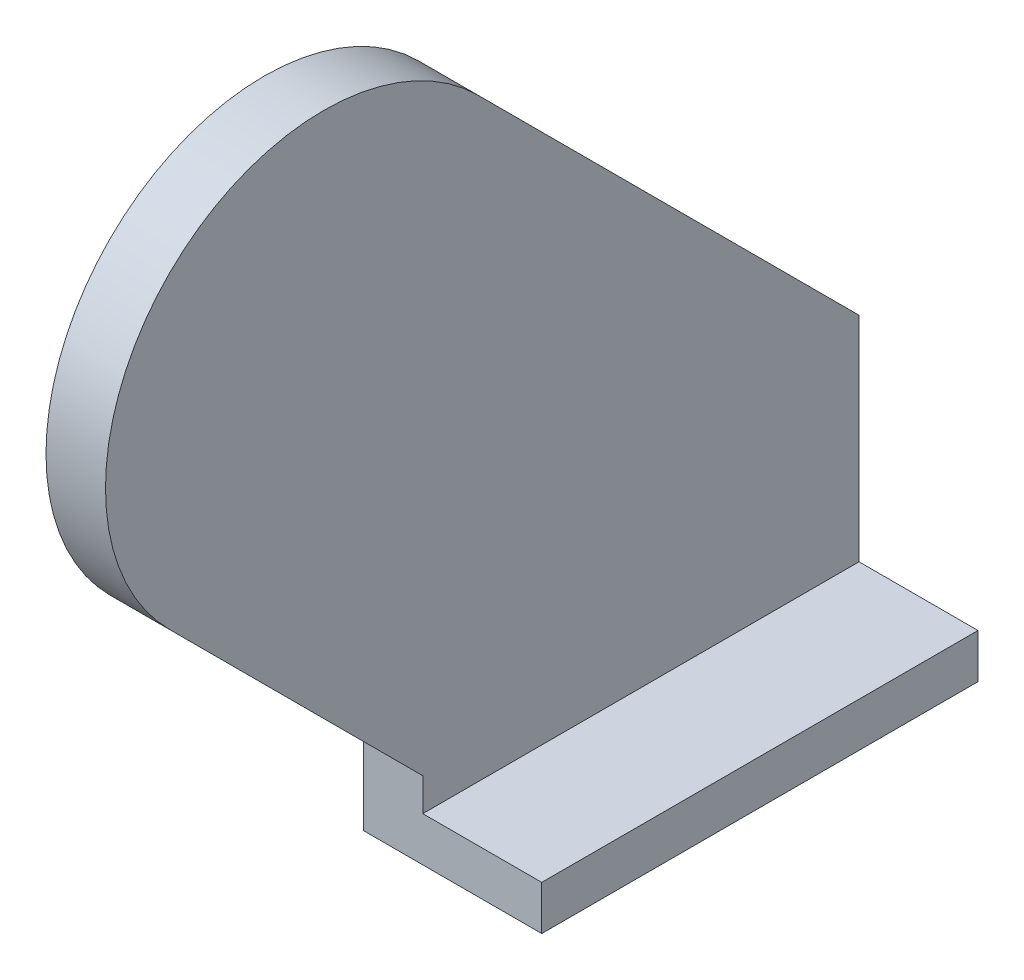
ISO-10303-21;
HEADER;
FILE_DESCRIPTION(('STEP AP214'),'2;1');
FILE_NAME('part.step','',(''),(''),'','','');
FILE_SCHEMA(('AUTOMOTIVE_DESIGN { 1 0 10303 214 1 1 1 1 }'));
ENDSEC;
DATA;
#1=APPLICATION_CONTEXT('core data for automotive mechanical design processes');
#2=APPLICATION_PROTOCOL_DEFINITION('international standard','automotive_design',2000,#1);
#3=PRODUCT_CONTEXT('',#1,'mechanical');
#4=PRODUCT('Part','Part','',(#3));
#5=PRODUCT_RELATED_PRODUCT_CATEGORY('part','',(#4));
#6=PRODUCT_DEFINITION_FORMATION('','',#4);
#7=PRODUCT_DEFINITION_CONTEXT('part definition',#1,'design');
#8=PRODUCT_DEFINITION('design','',#6,#7);
#9=PRODUCT_DEFINITION_SHAPE('','',#8);
#10=(LENGTH_UNIT() NAMED_UNIT(*) SI_UNIT(.MILLI.,.METRE.));
#11=(NAMED_UNIT(*) PLANE_ANGLE_UNIT() SI_UNIT($,.RADIAN.));
#12=(NAMED_UNIT(*) SI_UNIT($,.STERADIAN.) SOLID_ANGLE_UNIT());
#13=UNCERTAINTY_MEASURE_WITH_UNIT(LENGTH_MEASURE(1.E-05),#10,'distance_accuracy_value','');
#14=(GEOMETRIC_REPRESENTATION_CONTEXT(3) GLOBAL_UNCERTAINTY_ASSIGNED_CONTEXT((#13)) GLOBAL_UNIT_ASSIGNED_CONTEXT((#10,
#11,#12)) REPRESENTATION_CONTEXT('',''));
#15=CARTESIAN_POINT('',(0.,0.,0.));
#16=DIRECTION('',(0.,0.,1.));
#17=DIRECTION('',(1.,0.,0.));
#18=AXIS2_PLACEMENT_3D('',#15,#16,#17);
#19=CARTESIAN_POINT('',(61.5,-16.072077939,-4.828427125));
#20=DIRECTION('',(0.,-0.707106781186547,0.707106781186547));
#21=DIRECTION('',(0.,0.707106781186547,0.707106781186547));
#22=AXIS2_PLACEMENT_3D('',#19,#20,#21);
#23=PLANE('',#22);
#24=DIRECTION('',(0.,0.707106781186547,0.707106781186547));
#25=VECTOR('',#24,1.);
#26=CARTESIAN_POINT('',(58.5,-16.072077939,-4.828427125));
#27=LINE('',#26,#25);
#28=CARTESIAN_POINT('',(58.5,-17.243650814,-6.));
#29=VERTEX_POINT('',#28);
#30=CARTESIAN_POINT('',(58.5,1.97817459217873,13.2218254061267));
#31=VERTEX_POINT('',#30);
#32=EDGE_CURVE('E258',#29,#31,#27,.T.);
#33=ORIENTED_EDGE('',*,*,#32,.T.);
#34=DIRECTION('',(-1.,0.,0.));
#35=VECTOR('',#34,1.);
#36=CARTESIAN_POINT('',(60.,1.97817459135746,13.2218254052534));
#37=LINE('',#36,#35);
#38=CARTESIAN_POINT('',(61.5,1.97817459297517,13.2218254062661));
#39=VERTEX_POINT('',#38);
#40=EDGE_CURVE('E334',#31,#39,#37,.F.);
#41=ORIENTED_EDGE('',*,*,#40,.T.);
#42=DIRECTION('',(0.,0.707106781101469,0.707106781271627));
#43=VECTOR('',#42,1.);
#44=CARTESIAN_POINT('',(61.5,-16.0720779422184,-4.828427133876));
#45=LINE('',#44,#43);
#46=CARTESIAN_POINT('',(61.5,-17.243650814,-6.));
#47=VERTEX_POINT('',#46);
#48=EDGE_CURVE('E128',#47,#39,#45,.T.);
#49=ORIENTED_EDGE('',*,*,#48,.F.);
#50=DIRECTION('',(-1.,0.,0.));
#51=VECTOR('',#50,1.);
#52=CARTESIAN_POINT('',(58.5,-17.243650814,-6.));
#53=LINE('',#52,#51);
#54=EDGE_CURVE('E126',#47,#29,#53,.T.);
#55=ORIENTED_EDGE('',*,*,#54,.T.);
#56=EDGE_LOOP('',(#33,#41,#49,#55));
#57=FACE_BOUND('',#56,.T.);
#58=ADVANCED_FACE('F42',(#57),#23,.F.);
#59=CARTESIAN_POINT('',(61.5,-5.8,21.));
#60=DIRECTION('',(-1.,0.,0.));
#61=DIRECTION('',(0.,-1.,0.));
#62=AXIS2_PLACEMENT_3D('',#59,#60,#61);
#63=CYLINDRICAL_SURFACE('',#62,11.);
#64=ORIENTED_EDGE('',*,*,#40,.F.);
#65=CARTESIAN_POINT('',(58.5,-5.8,21.));
#66=DIRECTION('',(-1.,0.,0.));
#67=DIRECTION('',(0.,-1.,0.));
#68=AXIS2_PLACEMENT_3D('',#65,#66,#67);
#69=CIRCLE('',#68,11.);
#70=CARTESIAN_POINT('',(58.5,-13.578174593,28.778174593));
#71=VERTEX_POINT('',#70);
#72=EDGE_CURVE('E161',#31,#71,#69,.F.);
#73=ORIENTED_EDGE('',*,*,#72,.T.);
#74=DIRECTION('',(1.,0.,0.));
#75=VECTOR('',#74,1.);
#76=CARTESIAN_POINT('',(60.,-13.578174593,28.778174593));
#77=LINE('',#76,#75);
#78=CARTESIAN_POINT('',(61.5,-13.5781745846093,28.778174587786));
#79=VERTEX_POINT('',#78);
#80=EDGE_CURVE('E231',#71,#79,#77,.T.);
#81=ORIENTED_EDGE('',*,*,#80,.T.);
#82=CARTESIAN_POINT('',(61.5,-5.8,21.));
#83=DIRECTION('',(-1.,0.,0.));
#84=DIRECTION('',(0.,-1.,0.));
#85=AXIS2_PLACEMENT_3D('',#82,#83,#84);
#86=CIRCLE('',#85,11.);
#87=EDGE_CURVE('E315',#39,#79,#86,.F.);
#88=ORIENTED_EDGE('',*,*,#87,.F.);
#89=EDGE_LOOP('',(#64,#73,#81,#88));
#90=FACE_BOUND('',#89,.T.);
#91=ADVANCED_FACE('F340',(#90),#63,.T.);
#92=CARTESIAN_POINT('',(61.5,-13.578174593,28.778174593));
#93=DIRECTION('',(0.,0.707106781186548,-0.707106781186547));
#94=DIRECTION('',(0.,-0.707106781186547,-0.707106781186548));
#95=AXIS2_PLACEMENT_3D('',#92,#93,#94);
#96=PLANE('',#95);
#97=DIRECTION('',(0.,-0.707106781186547,-0.707106781186548));
#98=VECTOR('',#97,1.);
#99=CARTESIAN_POINT('',(58.5,-13.578174593,28.778174593));
#100=LINE('',#99,#98);
#101=CARTESIAN_POINT('',(58.5,-26.356349186,16.));
#102=VERTEX_POINT('',#101);
#103=EDGE_CURVE('E64',#71,#102,#100,.T.);
#104=ORIENTED_EDGE('',*,*,#103,.T.);
#105=DIRECTION('',(1.,0.,0.));
#106=VECTOR('',#105,1.);
#107=CARTESIAN_POINT('',(61.5,-26.356349186,16.));
#108=LINE('',#107,#106);
#109=CARTESIAN_POINT('',(61.5,-26.356349186,16.));
#110=VERTEX_POINT('',#109);
#111=EDGE_CURVE('E12',#110,#102,#108,.F.);
#112=ORIENTED_EDGE('',*,*,#111,.F.);
#113=DIRECTION('',(0.,-0.707106781475344,-0.707106780897751));
#114=VECTOR('',#113,1.);
#115=CARTESIAN_POINT('',(61.5,-13.5781745803226,28.778174578468));
#116=LINE('',#115,#114);
#117=EDGE_CURVE('E57',#79,#110,#116,.T.);
#118=ORIENTED_EDGE('',*,*,#117,.F.);
#119=ORIENTED_EDGE('',*,*,#80,.F.);
#120=EDGE_LOOP('',(#104,#112,#118,#119));
#121=FACE_BOUND('',#120,.T.);
#122=ADVANCED_FACE('F342',(#121),#96,.F.);
#123=CARTESIAN_POINT('',(58.5,-30.249489743,32.228));
#124=DIRECTION('',(1.,0.,0.));
#125=DIRECTION('',(0.,0.,-1.));
#126=AXIS2_PLACEMENT_3D('',#123,#124,#125);
#127=PLANE('',#126);
#128=ORIENTED_EDGE('',*,*,#103,.F.);
#129=ORIENTED_EDGE('',*,*,#72,.F.);
#130=ORIENTED_EDGE('',*,*,#32,.F.);
#131=DIRECTION('',(0.,1.,0.));
#132=VECTOR('',#131,1.);
#133=CARTESIAN_POINT('',(58.5,-24.574997403,-6.));
#134=LINE('',#133,#132);
#135=CARTESIAN_POINT('',(58.5,-30.249489743,-6.));
#136=VERTEX_POINT('',#135);
#137=EDGE_CURVE('E160',#136,#29,#134,.T.);
#138=ORIENTED_EDGE('',*,*,#137,.F.);
#139=DIRECTION('',(0.,0.,-1.));
#140=VECTOR('',#139,1.);
#141=CARTESIAN_POINT('',(58.5,-30.249489743,5.));
#142=LINE('',#141,#140);
#143=CARTESIAN_POINT('',(58.5,-30.249489743,16.));
#144=VERTEX_POINT('',#143);
#145=EDGE_CURVE('E301',#144,#136,#142,.T.);
#146=ORIENTED_EDGE('',*,*,#145,.F.);
#147=DIRECTION('',(0.,-1.,0.));
#148=VECTOR('',#147,1.);
#149=CARTESIAN_POINT('',(58.5,-29.1313465895,16.));
#150=LINE('',#149,#148);
#151=EDGE_CURVE('E215',#102,#144,#150,.T.);
#152=ORIENTED_EDGE('',*,*,#151,.F.);
#153=EDGE_LOOP('',(#128,#129,#130,#138,#146,#152));
#154=FACE_BOUND('',#153,.T.);
#155=ADVANCED_FACE('F344',(#154),#127,.F.);
#156=CARTESIAN_POINT('',(58.5,-18.900505063,-6.));
#157=DIRECTION('',(0.,0.,-1.));
#158=DIRECTION('',(1.,0.,0.));
#159=AXIS2_PLACEMENT_3D('',#156,#157,#158);
#160=PLANE('',#159);
#161=DIRECTION('',(0.,1.,0.));
#162=VECTOR('',#161,1.);
#163=CARTESIAN_POINT('',(67.5,-29.1313465895,-6.));
#164=LINE('',#163,#162);
#165=CARTESIAN_POINT('',(67.5,-30.249489743,-6.));
#166=VERTEX_POINT('',#165);
#167=CARTESIAN_POINT('',(67.5,-28.013203436,-6.));
#168=VERTEX_POINT('',#167);
#169=EDGE_CURVE('E229',#166,#168,#164,.T.);
#170=ORIENTED_EDGE('',*,*,#169,.F.);
#171=DIRECTION('',(1.,0.,0.));
#172=VECTOR('',#171,1.);
#173=CARTESIAN_POINT('',(63.,-30.249489743,-6.));
#174=LINE('',#173,#172);
#175=EDGE_CURVE('E198',#136,#166,#174,.T.);
#176=ORIENTED_EDGE('',*,*,#175,.F.);
#177=ORIENTED_EDGE('',*,*,#137,.T.);
#178=ORIENTED_EDGE('',*,*,#54,.F.);
#179=DIRECTION('',(0.,1.,0.));
#180=VECTOR('',#179,1.);
#181=CARTESIAN_POINT('',(61.5,-11.3069621075,-6.));
#182=LINE('',#181,#180);
#183=CARTESIAN_POINT('',(61.5,-28.013203436,-6.));
#184=VERTEX_POINT('',#183);
#185=EDGE_CURVE('E123',#184,#47,#182,.T.);
#186=ORIENTED_EDGE('',*,*,#185,.F.);
#187=DIRECTION('',(1.,0.,0.));
#188=VECTOR('',#187,1.);
#189=CARTESIAN_POINT('',(64.5,-28.013203436,-6.));
#190=LINE('',#189,#188);
#191=EDGE_CURVE('E108',#184,#168,#190,.T.);
#192=ORIENTED_EDGE('',*,*,#191,.T.);
#193=EDGE_LOOP('',(#170,#176,#177,#178,#186,#192));
#194=FACE_BOUND('',#193,.T.);
#195=ADVANCED_FACE('F124',(#194),#160,.T.);
#196=CARTESIAN_POINT('',(67.5,-30.249489743,16.));
#197=DIRECTION('',(1.,0.,0.));
#198=DIRECTION('',(0.,0.,-1.));
#199=AXIS2_PLACEMENT_3D('',#196,#197,#198);
#200=PLANE('',#199);
#201=ORIENTED_EDGE('',*,*,#169,.T.);
#202=DIRECTION('',(0.,0.,1.));
#203=VECTOR('',#202,1.);
#204=CARTESIAN_POINT('',(67.5,-28.013203436,5.));
#205=LINE('',#204,#203);
#206=CARTESIAN_POINT('',(67.5,-28.013203436,16.));
#207=VERTEX_POINT('',#206);
#208=EDGE_CURVE('E115',#168,#207,#205,.T.);
#209=ORIENTED_EDGE('',*,*,#208,.T.);
#210=DIRECTION('',(0.,1.,0.));
#211=VECTOR('',#210,1.);
#212=CARTESIAN_POINT('',(67.5,-29.1313465895,16.));
#213=LINE('',#212,#211);
#214=CARTESIAN_POINT('',(67.5,-30.249489743,16.));
#215=VERTEX_POINT('',#214);
#216=EDGE_CURVE('E129',#215,#207,#213,.T.);
#217=ORIENTED_EDGE('',*,*,#216,.F.);
#218=DIRECTION('',(0.,0.,1.));
#219=VECTOR('',#218,1.);
#220=CARTESIAN_POINT('',(67.5,-30.249489743,5.));
#221=LINE('',#220,#219);
#222=EDGE_CURVE('E119',#166,#215,#221,.T.);
#223=ORIENTED_EDGE('',*,*,#222,.F.);
#224=EDGE_LOOP('',(#201,#209,#217,#223));
#225=FACE_BOUND('',#224,.T.);
#226=ADVANCED_FACE('F271',(#225),#200,.T.);
#227=CARTESIAN_POINT('',(67.5,-30.249489743,16.));
#228=DIRECTION('',(0.,0.,1.));
#229=DIRECTION('',(0.,1.,0.));
#230=AXIS2_PLACEMENT_3D('',#227,#228,#229);
#231=PLANE('',#230);
#232=DIRECTION('',(-1.,0.,0.));
#233=VECTOR('',#232,1.);
#234=CARTESIAN_POINT('',(64.5,-28.013203436,16.));
#235=LINE('',#234,#233);
#236=CARTESIAN_POINT('',(61.4999999985,-28.013203436,16.0000000001741));
#237=VERTEX_POINT('',#236);
#238=EDGE_CURVE('E134',#207,#237,#235,.T.);
#239=ORIENTED_EDGE('',*,*,#238,.T.);
#240=DIRECTION('',(0.,-1.,0.));
#241=VECTOR('',#240,1.);
#242=CARTESIAN_POINT('',(61.5,5.399279221,16.));
#243=LINE('',#242,#241);
#244=EDGE_CURVE('E50',#237,#110,#243,.F.);
#245=ORIENTED_EDGE('',*,*,#244,.T.);
#246=ORIENTED_EDGE('',*,*,#111,.T.);
#247=ORIENTED_EDGE('',*,*,#151,.T.);
#248=DIRECTION('',(-1.,0.,0.));
#249=VECTOR('',#248,1.);
#250=CARTESIAN_POINT('',(63.,-30.249489743,16.));
#251=LINE('',#250,#249);
#252=EDGE_CURVE('E213',#215,#144,#251,.T.);
#253=ORIENTED_EDGE('',*,*,#252,.F.);
#254=ORIENTED_EDGE('',*,*,#216,.T.);
#255=EDGE_LOOP('',(#239,#245,#246,#247,#253,#254));
#256=FACE_BOUND('',#255,.T.);
#257=ADVANCED_FACE('F267',(#256),#231,.T.);
#258=CARTESIAN_POINT('',(61.5,5.399279221,32.228));
#259=DIRECTION('',(1.,0.,0.));
#260=DIRECTION('',(0.,-1.,0.));
#261=AXIS2_PLACEMENT_3D('',#258,#259,#260);
#262=PLANE('',#261);
#263=ORIENTED_EDGE('',*,*,#117,.T.);
#264=ORIENTED_EDGE('',*,*,#244,.F.);
#265=DIRECTION('',(0.,0.,-1.));
#266=VECTOR('',#265,1.);
#267=CARTESIAN_POINT('',(61.5,-28.013203436,5.));
#268=LINE('',#267,#266);
#269=EDGE_CURVE('E112',#237,#184,#268,.T.);
#270=ORIENTED_EDGE('',*,*,#269,.T.);
#271=ORIENTED_EDGE('',*,*,#185,.T.);
#272=ORIENTED_EDGE('',*,*,#48,.T.);
#273=ORIENTED_EDGE('',*,*,#87,.T.);
#274=EDGE_LOOP('',(#263,#264,#270,#271,#272,#273));
#275=FACE_BOUND('',#274,.T.);
#276=ADVANCED_FACE('F131',(#275),#262,.T.);
#277=CARTESIAN_POINT('',(58.5,-30.249489743,16.));
#278=DIRECTION('',(0.,-1.,0.));
#279=DIRECTION('',(0.,0.,-1.));
#280=AXIS2_PLACEMENT_3D('',#277,#278,#279);
#281=PLANE('',#280);
#282=ORIENTED_EDGE('',*,*,#252,.T.);
#283=ORIENTED_EDGE('',*,*,#145,.T.);
#284=ORIENTED_EDGE('',*,*,#175,.T.);
#285=ORIENTED_EDGE('',*,*,#222,.T.);
#286=EDGE_LOOP('',(#282,#283,#284,#285));
#287=FACE_BOUND('',#286,.T.);
#288=ADVANCED_FACE('F355',(#287),#281,.T.);
#289=CARTESIAN_POINT('',(61.5,-28.013203436,16.));
#290=DIRECTION('',(0.,-1.,0.));
#291=DIRECTION('',(0.,0.,-1.));
#292=AXIS2_PLACEMENT_3D('',#289,#290,#291);
#293=PLANE('',#292);
#294=ORIENTED_EDGE('',*,*,#238,.F.);
#295=ORIENTED_EDGE('',*,*,#208,.F.);
#296=ORIENTED_EDGE('',*,*,#191,.F.);
#297=ORIENTED_EDGE('',*,*,#269,.F.);
#298=EDGE_LOOP('',(#294,#295,#296,#297));
#299=FACE_BOUND('',#298,.T.);
#300=ADVANCED_FACE('F44',(#299),#293,.F.);
#301=CLOSED_SHELL('',(#58,#91,#122,#155,#195,#226,#257,#276,#288,#300));
#302=MANIFOLD_SOLID_BREP('B2',#301);
#303=ADVANCED_BREP_SHAPE_REPRESENTATION('',(#18,#302),#14);
#304=SHAPE_DEFINITION_REPRESENTATION(#9,#303);
ENDSEC;
END-ISO-10303-21;
